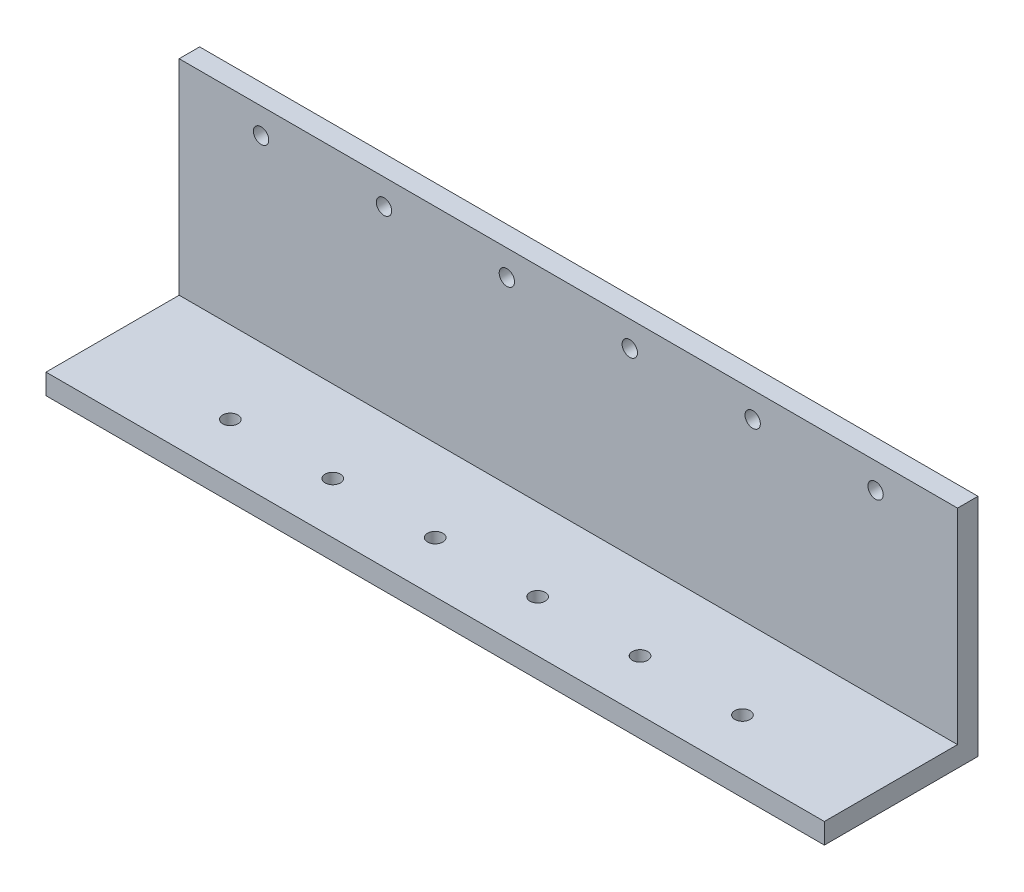
ISO-10303-21;
HEADER;
FILE_DESCRIPTION(('STEP AP214'),'2;1');
FILE_NAME('part.step','',(''),(''),'','','');
FILE_SCHEMA(('AUTOMOTIVE_DESIGN { 1 0 10303 214 1 1 1 1 }'));
ENDSEC;
DATA;
#1=APPLICATION_CONTEXT('core data for automotive mechanical design processes');
#2=APPLICATION_PROTOCOL_DEFINITION('international standard','automotive_design',2000,#1);
#3=PRODUCT_CONTEXT('',#1,'mechanical');
#4=PRODUCT('Part','Part','',(#3));
#5=PRODUCT_RELATED_PRODUCT_CATEGORY('part','',(#4));
#6=PRODUCT_DEFINITION_FORMATION('','',#4);
#7=PRODUCT_DEFINITION_CONTEXT('part definition',#1,'design');
#8=PRODUCT_DEFINITION('design','',#6,#7);
#9=PRODUCT_DEFINITION_SHAPE('','',#8);
#10=(LENGTH_UNIT() NAMED_UNIT(*) SI_UNIT(.MILLI.,.METRE.));
#11=(NAMED_UNIT(*) PLANE_ANGLE_UNIT() SI_UNIT($,.RADIAN.));
#12=(NAMED_UNIT(*) SI_UNIT($,.STERADIAN.) SOLID_ANGLE_UNIT());
#13=UNCERTAINTY_MEASURE_WITH_UNIT(LENGTH_MEASURE(1.E-05),#10,'distance_accuracy_value','');
#14=(GEOMETRIC_REPRESENTATION_CONTEXT(3) GLOBAL_UNCERTAINTY_ASSIGNED_CONTEXT((#13)) GLOBAL_UNIT_ASSIGNED_CONTEXT((#10,
#11,#12)) REPRESENTATION_CONTEXT('',''));
#15=CARTESIAN_POINT('',(0.,0.,0.));
#16=DIRECTION('',(0.,0.,1.));
#17=DIRECTION('',(1.,0.,0.));
#18=AXIS2_PLACEMENT_3D('',#15,#16,#17);
#19=CARTESIAN_POINT('',(0.,0.,2.));
#20=DIRECTION('',(0.,0.,-1.));
#21=DIRECTION('',(-1.,0.,0.));
#22=AXIS2_PLACEMENT_3D('',#19,#20,#21);
#23=PLANE('',#22);
#24=DIRECTION('',(0.,-1.,0.));
#25=VECTOR('',#24,1.);
#26=CARTESIAN_POINT('',(0.,0.,2.));
#27=LINE('',#26,#25);
#28=CARTESIAN_POINT('',(0.,20.,2.));
#29=VERTEX_POINT('',#28);
#30=CARTESIAN_POINT('',(0.,0.,2.));
#31=VERTEX_POINT('',#30);
#32=EDGE_CURVE('E102',#29,#31,#27,.T.);
#33=ORIENTED_EDGE('',*,*,#32,.T.);
#34=DIRECTION('',(1.,0.,0.));
#35=VECTOR('',#34,1.);
#36=CARTESIAN_POINT('',(0.,0.,2.));
#37=LINE('',#36,#35);
#38=CARTESIAN_POINT('',(76.,0.,2.));
#39=VERTEX_POINT('',#38);
#40=EDGE_CURVE('E78',#31,#39,#37,.T.);
#41=ORIENTED_EDGE('',*,*,#40,.T.);
#42=DIRECTION('',(0.,1.,0.));
#43=VECTOR('',#42,1.);
#44=CARTESIAN_POINT('',(76.,0.,2.));
#45=LINE('',#44,#43);
#46=CARTESIAN_POINT('',(76.,20.,2.));
#47=VERTEX_POINT('',#46);
#48=EDGE_CURVE('E100',#39,#47,#45,.T.);
#49=ORIENTED_EDGE('',*,*,#48,.T.);
#50=DIRECTION('',(-1.,0.,0.));
#51=VECTOR('',#50,1.);
#52=CARTESIAN_POINT('',(0.,20.,2.));
#53=LINE('',#52,#51);
#54=EDGE_CURVE('E57',#47,#29,#53,.T.);
#55=ORIENTED_EDGE('',*,*,#54,.T.);
#56=EDGE_LOOP('',(#33,#41,#49,#55));
#57=FACE_BOUND('',#56,.T.);
#58=CARTESIAN_POINT('',(44.,17.5,2.));
#59=DIRECTION('',(0.,0.,1.));
#60=DIRECTION('',(1.,0.,0.));
#61=AXIS2_PLACEMENT_3D('',#58,#59,#60);
#62=CIRCLE('',#61,0.749999999999999);
#63=CARTESIAN_POINT('',(44.75,17.5,2.));
#64=VERTEX_POINT('',#63);
#65=EDGE_CURVE('E116',#64,#64,#62,.T.);
#66=ORIENTED_EDGE('',*,*,#65,.F.);
#67=EDGE_LOOP('',(#66));
#68=FACE_BOUND('',#67,.T.);
#69=CARTESIAN_POINT('',(56.,17.5,2.));
#70=DIRECTION('',(0.,0.,1.));
#71=DIRECTION('',(1.,0.,0.));
#72=AXIS2_PLACEMENT_3D('',#69,#70,#71);
#73=CIRCLE('',#72,0.749999999999999);
#74=CARTESIAN_POINT('',(56.75,17.5,2.));
#75=VERTEX_POINT('',#74);
#76=EDGE_CURVE('E193',#75,#75,#73,.T.);
#77=ORIENTED_EDGE('',*,*,#76,.F.);
#78=EDGE_LOOP('',(#77));
#79=FACE_BOUND('',#78,.T.);
#80=CARTESIAN_POINT('',(68.,17.5,2.));
#81=DIRECTION('',(0.,0.,1.));
#82=DIRECTION('',(1.,0.,0.));
#83=AXIS2_PLACEMENT_3D('',#80,#81,#82);
#84=CIRCLE('',#83,0.749999999999999);
#85=CARTESIAN_POINT('',(68.75,17.5,2.));
#86=VERTEX_POINT('',#85);
#87=EDGE_CURVE('E185',#86,#86,#84,.T.);
#88=ORIENTED_EDGE('',*,*,#87,.F.);
#89=EDGE_LOOP('',(#88));
#90=FACE_BOUND('',#89,.T.);
#91=CARTESIAN_POINT('',(32.,17.5,2.));
#92=DIRECTION('',(0.,0.,1.));
#93=DIRECTION('',(1.,0.,0.));
#94=AXIS2_PLACEMENT_3D('',#91,#92,#93);
#95=CIRCLE('',#94,0.749999999999999);
#96=CARTESIAN_POINT('',(32.75,17.5,2.));
#97=VERTEX_POINT('',#96);
#98=EDGE_CURVE('E177',#97,#97,#95,.T.);
#99=ORIENTED_EDGE('',*,*,#98,.F.);
#100=EDGE_LOOP('',(#99));
#101=FACE_BOUND('',#100,.T.);
#102=CARTESIAN_POINT('',(20.,17.5,2.));
#103=DIRECTION('',(0.,0.,1.));
#104=DIRECTION('',(1.,0.,0.));
#105=AXIS2_PLACEMENT_3D('',#102,#103,#104);
#106=CIRCLE('',#105,0.749999999999999);
#107=CARTESIAN_POINT('',(20.75,17.5,2.));
#108=VERTEX_POINT('',#107);
#109=EDGE_CURVE('E169',#108,#108,#106,.T.);
#110=ORIENTED_EDGE('',*,*,#109,.F.);
#111=EDGE_LOOP('',(#110));
#112=FACE_BOUND('',#111,.T.);
#113=CARTESIAN_POINT('',(8.,17.5,2.));
#114=DIRECTION('',(0.,0.,1.));
#115=DIRECTION('',(1.,0.,0.));
#116=AXIS2_PLACEMENT_3D('',#113,#114,#115);
#117=CIRCLE('',#116,0.749999999999999);
#118=CARTESIAN_POINT('',(8.75,17.5,2.));
#119=VERTEX_POINT('',#118);
#120=EDGE_CURVE('E161',#119,#119,#117,.T.);
#121=ORIENTED_EDGE('',*,*,#120,.F.);
#122=EDGE_LOOP('',(#121));
#123=FACE_BOUND('',#122,.T.);
#124=ADVANCED_FACE('F39',(#57,#68,#79,#90,#101,#112,#123),#23,.F.);
#125=CARTESIAN_POINT('',(0.,0.,0.));
#126=DIRECTION('',(0.,0.,-1.));
#127=DIRECTION('',(-1.,0.,0.));
#128=AXIS2_PLACEMENT_3D('',#125,#126,#127);
#129=PLANE('',#128);
#130=CARTESIAN_POINT('',(20.,17.5,0.));
#131=DIRECTION('',(0.,0.,1.));
#132=DIRECTION('',(1.,0.,0.));
#133=AXIS2_PLACEMENT_3D('',#130,#131,#132);
#134=CIRCLE('',#133,0.749999999999999);
#135=CARTESIAN_POINT('',(20.75,17.5,0.));
#136=VERTEX_POINT('',#135);
#137=EDGE_CURVE('E165',#136,#136,#134,.T.);
#138=ORIENTED_EDGE('',*,*,#137,.T.);
#139=EDGE_LOOP('',(#138));
#140=FACE_BOUND('',#139,.T.);
#141=CARTESIAN_POINT('',(68.,17.5,0.));
#142=DIRECTION('',(0.,0.,1.));
#143=DIRECTION('',(1.,0.,0.));
#144=AXIS2_PLACEMENT_3D('',#141,#142,#143);
#145=CIRCLE('',#144,0.749999999999999);
#146=CARTESIAN_POINT('',(68.75,17.5,0.));
#147=VERTEX_POINT('',#146);
#148=EDGE_CURVE('E181',#147,#147,#145,.T.);
#149=ORIENTED_EDGE('',*,*,#148,.T.);
#150=EDGE_LOOP('',(#149));
#151=FACE_BOUND('',#150,.T.);
#152=CARTESIAN_POINT('',(44.,17.5,0.));
#153=DIRECTION('',(0.,0.,1.));
#154=DIRECTION('',(1.,0.,0.));
#155=AXIS2_PLACEMENT_3D('',#152,#153,#154);
#156=CIRCLE('',#155,0.749999999999999);
#157=CARTESIAN_POINT('',(44.75,17.5,0.));
#158=VERTEX_POINT('',#157);
#159=EDGE_CURVE('E197',#158,#158,#156,.T.);
#160=ORIENTED_EDGE('',*,*,#159,.T.);
#161=EDGE_LOOP('',(#160));
#162=FACE_BOUND('',#161,.T.);
#163=DIRECTION('',(0.,-1.,0.));
#164=VECTOR('',#163,1.);
#165=CARTESIAN_POINT('',(0.,0.,0.));
#166=LINE('',#165,#164);
#167=CARTESIAN_POINT('',(0.,20.,0.));
#168=VERTEX_POINT('',#167);
#169=CARTESIAN_POINT('',(0.,-2.,0.));
#170=VERTEX_POINT('',#169);
#171=EDGE_CURVE('E112',#168,#170,#166,.T.);
#172=ORIENTED_EDGE('',*,*,#171,.F.);
#173=DIRECTION('',(-1.,0.,0.));
#174=VECTOR('',#173,1.);
#175=CARTESIAN_POINT('',(0.,20.,0.));
#176=LINE('',#175,#174);
#177=CARTESIAN_POINT('',(76.,20.,0.));
#178=VERTEX_POINT('',#177);
#179=EDGE_CURVE('E119',#178,#168,#176,.T.);
#180=ORIENTED_EDGE('',*,*,#179,.F.);
#181=DIRECTION('',(0.,1.,0.));
#182=VECTOR('',#181,1.);
#183=CARTESIAN_POINT('',(76.,0.,0.));
#184=LINE('',#183,#182);
#185=CARTESIAN_POINT('',(76.,-2.,0.));
#186=VERTEX_POINT('',#185);
#187=EDGE_CURVE('E69',#186,#178,#184,.T.);
#188=ORIENTED_EDGE('',*,*,#187,.F.);
#189=DIRECTION('',(1.,0.,0.));
#190=VECTOR('',#189,1.);
#191=CARTESIAN_POINT('',(76.,-2.,0.));
#192=LINE('',#191,#190);
#193=EDGE_CURVE('E134',#170,#186,#192,.T.);
#194=ORIENTED_EDGE('',*,*,#193,.F.);
#195=EDGE_LOOP('',(#172,#180,#188,#194));
#196=FACE_BOUND('',#195,.T.);
#197=CARTESIAN_POINT('',(56.,17.5,0.));
#198=DIRECTION('',(0.,0.,1.));
#199=DIRECTION('',(1.,0.,0.));
#200=AXIS2_PLACEMENT_3D('',#197,#198,#199);
#201=CIRCLE('',#200,0.749999999999999);
#202=CARTESIAN_POINT('',(56.75,17.5,0.));
#203=VERTEX_POINT('',#202);
#204=EDGE_CURVE('E189',#203,#203,#201,.T.);
#205=ORIENTED_EDGE('',*,*,#204,.T.);
#206=EDGE_LOOP('',(#205));
#207=FACE_BOUND('',#206,.T.);
#208=CARTESIAN_POINT('',(32.,17.5,0.));
#209=DIRECTION('',(0.,0.,1.));
#210=DIRECTION('',(1.,0.,0.));
#211=AXIS2_PLACEMENT_3D('',#208,#209,#210);
#212=CIRCLE('',#211,0.749999999999999);
#213=CARTESIAN_POINT('',(32.75,17.5,0.));
#214=VERTEX_POINT('',#213);
#215=EDGE_CURVE('E173',#214,#214,#212,.T.);
#216=ORIENTED_EDGE('',*,*,#215,.T.);
#217=EDGE_LOOP('',(#216));
#218=FACE_BOUND('',#217,.T.);
#219=CARTESIAN_POINT('',(8.,17.5,0.));
#220=DIRECTION('',(0.,0.,1.));
#221=DIRECTION('',(1.,0.,0.));
#222=AXIS2_PLACEMENT_3D('',#219,#220,#221);
#223=CIRCLE('',#222,0.749999999999999);
#224=CARTESIAN_POINT('',(8.75,17.5,0.));
#225=VERTEX_POINT('',#224);
#226=EDGE_CURVE('E160',#225,#225,#223,.T.);
#227=ORIENTED_EDGE('',*,*,#226,.T.);
#228=EDGE_LOOP('',(#227));
#229=FACE_BOUND('',#228,.T.);
#230=ADVANCED_FACE('F131',(#140,#151,#162,#196,#207,#218,#229),#129,.T.);
#231=CARTESIAN_POINT('',(0.,0.,2.));
#232=DIRECTION('',(1.,0.,0.));
#233=DIRECTION('',(0.,0.,-1.));
#234=AXIS2_PLACEMENT_3D('',#231,#232,#233);
#235=PLANE('',#234);
#236=ORIENTED_EDGE('',*,*,#171,.T.);
#237=DIRECTION('',(0.,0.,-1.));
#238=VECTOR('',#237,1.);
#239=CARTESIAN_POINT('',(0.,-2.,0.));
#240=LINE('',#239,#238);
#241=CARTESIAN_POINT('',(0.,-2.,15.));
#242=VERTEX_POINT('',#241);
#243=EDGE_CURVE('E141',#242,#170,#240,.T.);
#244=ORIENTED_EDGE('',*,*,#243,.F.);
#245=DIRECTION('',(0.,1.,0.));
#246=VECTOR('',#245,1.);
#247=CARTESIAN_POINT('',(0.,-2.,15.));
#248=LINE('',#247,#246);
#249=CARTESIAN_POINT('',(0.,0.,15.));
#250=VERTEX_POINT('',#249);
#251=EDGE_CURVE('E140',#242,#250,#248,.T.);
#252=ORIENTED_EDGE('',*,*,#251,.T.);
#253=DIRECTION('',(0.,0.,-1.));
#254=VECTOR('',#253,1.);
#255=CARTESIAN_POINT('',(0.,0.,0.));
#256=LINE('',#255,#254);
#257=EDGE_CURVE('E154',#250,#31,#256,.T.);
#258=ORIENTED_EDGE('',*,*,#257,.T.);
#259=ORIENTED_EDGE('',*,*,#32,.F.);
#260=DIRECTION('',(0.,0.,-1.));
#261=VECTOR('',#260,1.);
#262=CARTESIAN_POINT('',(0.,20.,2.));
#263=LINE('',#262,#261);
#264=EDGE_CURVE('E49',#29,#168,#263,.T.);
#265=ORIENTED_EDGE('',*,*,#264,.T.);
#266=EDGE_LOOP('',(#236,#244,#252,#258,#259,#265));
#267=FACE_BOUND('',#266,.T.);
#268=ADVANCED_FACE('F41',(#267),#235,.F.);
#269=CARTESIAN_POINT('',(76.,0.,2.));
#270=DIRECTION('',(-1.,0.,0.));
#271=DIRECTION('',(0.,0.,1.));
#272=AXIS2_PLACEMENT_3D('',#269,#270,#271);
#273=PLANE('',#272);
#274=ORIENTED_EDGE('',*,*,#187,.T.);
#275=DIRECTION('',(0.,0.,-1.));
#276=VECTOR('',#275,1.);
#277=CARTESIAN_POINT('',(76.,20.,2.));
#278=LINE('',#277,#276);
#279=EDGE_CURVE('E11',#47,#178,#278,.T.);
#280=ORIENTED_EDGE('',*,*,#279,.F.);
#281=ORIENTED_EDGE('',*,*,#48,.F.);
#282=DIRECTION('',(0.,0.,1.));
#283=VECTOR('',#282,1.);
#284=CARTESIAN_POINT('',(76.,0.,0.));
#285=LINE('',#284,#283);
#286=CARTESIAN_POINT('',(76.,0.,15.));
#287=VERTEX_POINT('',#286);
#288=EDGE_CURVE('E87',#39,#287,#285,.T.);
#289=ORIENTED_EDGE('',*,*,#288,.T.);
#290=DIRECTION('',(0.,1.,0.));
#291=VECTOR('',#290,1.);
#292=CARTESIAN_POINT('',(76.,-2.,15.));
#293=LINE('',#292,#291);
#294=CARTESIAN_POINT('',(76.,-2.,15.));
#295=VERTEX_POINT('',#294);
#296=EDGE_CURVE('E146',#295,#287,#293,.T.);
#297=ORIENTED_EDGE('',*,*,#296,.F.);
#298=DIRECTION('',(0.,0.,1.));
#299=VECTOR('',#298,1.);
#300=CARTESIAN_POINT('',(76.,-2.,0.));
#301=LINE('',#300,#299);
#302=EDGE_CURVE('E156',#186,#295,#301,.T.);
#303=ORIENTED_EDGE('',*,*,#302,.F.);
#304=EDGE_LOOP('',(#274,#280,#281,#289,#297,#303));
#305=FACE_BOUND('',#304,.T.);
#306=ADVANCED_FACE('F105',(#305),#273,.F.);
#307=CARTESIAN_POINT('',(0.,20.,2.));
#308=DIRECTION('',(0.,-1.,0.));
#309=DIRECTION('',(0.,0.,-1.));
#310=AXIS2_PLACEMENT_3D('',#307,#308,#309);
#311=PLANE('',#310);
#312=ORIENTED_EDGE('',*,*,#179,.T.);
#313=ORIENTED_EDGE('',*,*,#264,.F.);
#314=ORIENTED_EDGE('',*,*,#54,.F.);
#315=ORIENTED_EDGE('',*,*,#279,.T.);
#316=EDGE_LOOP('',(#312,#313,#314,#315));
#317=FACE_BOUND('',#316,.T.);
#318=ADVANCED_FACE('F213',(#317),#311,.F.);
#319=CARTESIAN_POINT('',(44.,17.5,2.));
#320=DIRECTION('',(0.,0.,-1.));
#321=DIRECTION('',(-1.,0.,0.));
#322=AXIS2_PLACEMENT_3D('',#319,#320,#321);
#323=CYLINDRICAL_SURFACE('',#322,0.749999999999999);
#324=ORIENTED_EDGE('',*,*,#65,.T.);
#325=EDGE_LOOP('',(#324));
#326=FACE_BOUND('',#325,.T.);
#327=ORIENTED_EDGE('',*,*,#159,.F.);
#328=EDGE_LOOP('',(#327));
#329=FACE_BOUND('',#328,.T.);
#330=ADVANCED_FACE('F210',(#326,#329),#323,.F.);
#331=CARTESIAN_POINT('',(56.,17.5,2.));
#332=DIRECTION('',(0.,0.,-1.));
#333=DIRECTION('',(-1.,0.,0.));
#334=AXIS2_PLACEMENT_3D('',#331,#332,#333);
#335=CYLINDRICAL_SURFACE('',#334,0.749999999999999);
#336=ORIENTED_EDGE('',*,*,#76,.T.);
#337=EDGE_LOOP('',(#336));
#338=FACE_BOUND('',#337,.T.);
#339=ORIENTED_EDGE('',*,*,#204,.F.);
#340=EDGE_LOOP('',(#339));
#341=FACE_BOUND('',#340,.T.);
#342=ADVANCED_FACE('F212',(#338,#341),#335,.F.);
#343=CARTESIAN_POINT('',(68.,17.5,2.));
#344=DIRECTION('',(0.,0.,-1.));
#345=DIRECTION('',(-1.,0.,0.));
#346=AXIS2_PLACEMENT_3D('',#343,#344,#345);
#347=CYLINDRICAL_SURFACE('',#346,0.749999999999999);
#348=ORIENTED_EDGE('',*,*,#87,.T.);
#349=EDGE_LOOP('',(#348));
#350=FACE_BOUND('',#349,.T.);
#351=ORIENTED_EDGE('',*,*,#148,.F.);
#352=EDGE_LOOP('',(#351));
#353=FACE_BOUND('',#352,.T.);
#354=ADVANCED_FACE('F220',(#350,#353),#347,.F.);
#355=CARTESIAN_POINT('',(32.,17.5,2.));
#356=DIRECTION('',(0.,0.,-1.));
#357=DIRECTION('',(-1.,0.,0.));
#358=AXIS2_PLACEMENT_3D('',#355,#356,#357);
#359=CYLINDRICAL_SURFACE('',#358,0.749999999999999);
#360=ORIENTED_EDGE('',*,*,#98,.T.);
#361=EDGE_LOOP('',(#360));
#362=FACE_BOUND('',#361,.T.);
#363=ORIENTED_EDGE('',*,*,#215,.F.);
#364=EDGE_LOOP('',(#363));
#365=FACE_BOUND('',#364,.T.);
#366=ADVANCED_FACE('F268',(#362,#365),#359,.F.);
#367=CARTESIAN_POINT('',(20.,17.5,2.));
#368=DIRECTION('',(0.,0.,-1.));
#369=DIRECTION('',(-1.,0.,0.));
#370=AXIS2_PLACEMENT_3D('',#367,#368,#369);
#371=CYLINDRICAL_SURFACE('',#370,0.749999999999999);
#372=ORIENTED_EDGE('',*,*,#109,.T.);
#373=EDGE_LOOP('',(#372));
#374=FACE_BOUND('',#373,.T.);
#375=ORIENTED_EDGE('',*,*,#137,.F.);
#376=EDGE_LOOP('',(#375));
#377=FACE_BOUND('',#376,.T.);
#378=ADVANCED_FACE('F257',(#374,#377),#371,.F.);
#379=CARTESIAN_POINT('',(8.,17.5,2.));
#380=DIRECTION('',(0.,0.,-1.));
#381=DIRECTION('',(-1.,0.,0.));
#382=AXIS2_PLACEMENT_3D('',#379,#380,#381);
#383=CYLINDRICAL_SURFACE('',#382,0.749999999999999);
#384=ORIENTED_EDGE('',*,*,#120,.T.);
#385=EDGE_LOOP('',(#384));
#386=FACE_BOUND('',#385,.T.);
#387=ORIENTED_EDGE('',*,*,#226,.F.);
#388=EDGE_LOOP('',(#387));
#389=FACE_BOUND('',#388,.T.);
#390=ADVANCED_FACE('F252',(#386,#389),#383,.F.);
#391=CARTESIAN_POINT('',(0.,-2.,0.));
#392=DIRECTION('',(0.,-1.,0.));
#393=DIRECTION('',(0.,0.,-1.));
#394=AXIS2_PLACEMENT_3D('',#391,#392,#393);
#395=PLANE('',#394);
#396=CARTESIAN_POINT('',(53.,-2.,10.));
#397=DIRECTION('',(0.,-1.,0.));
#398=DIRECTION('',(0.,0.,-1.));
#399=AXIS2_PLACEMENT_3D('',#396,#397,#398);
#400=CIRCLE('',#399,0.749999999999999);
#401=CARTESIAN_POINT('',(53.,-2.,9.25000000000001));
#402=VERTEX_POINT('',#401);
#403=EDGE_CURVE('E421',#402,#402,#400,.T.);
#404=ORIENTED_EDGE('',*,*,#403,.F.);
#405=EDGE_LOOP('',(#404));
#406=FACE_BOUND('',#405,.T.);
#407=CARTESIAN_POINT('',(33.,-2.,10.));
#408=DIRECTION('',(0.,-1.,0.));
#409=DIRECTION('',(0.,0.,-1.));
#410=AXIS2_PLACEMENT_3D('',#407,#408,#409);
#411=CIRCLE('',#410,0.749999999999999);
#412=CARTESIAN_POINT('',(33.,-2.,9.25));
#413=VERTEX_POINT('',#412);
#414=EDGE_CURVE('E437',#413,#413,#411,.T.);
#415=ORIENTED_EDGE('',*,*,#414,.F.);
#416=EDGE_LOOP('',(#415));
#417=FACE_BOUND('',#416,.T.);
#418=CARTESIAN_POINT('',(13.,-2.,10.));
#419=DIRECTION('',(0.,-1.,0.));
#420=DIRECTION('',(0.,0.,-1.));
#421=AXIS2_PLACEMENT_3D('',#418,#419,#420);
#422=CIRCLE('',#421,0.75);
#423=CARTESIAN_POINT('',(13.,-2.,9.25));
#424=VERTEX_POINT('',#423);
#425=EDGE_CURVE('E97',#424,#424,#422,.T.);
#426=ORIENTED_EDGE('',*,*,#425,.F.);
#427=EDGE_LOOP('',(#426));
#428=FACE_BOUND('',#427,.T.);
#429=ORIENTED_EDGE('',*,*,#302,.T.);
#430=DIRECTION('',(-1.,0.,0.));
#431=VECTOR('',#430,1.);
#432=CARTESIAN_POINT('',(76.,-2.,15.));
#433=LINE('',#432,#431);
#434=EDGE_CURVE('E148',#295,#242,#433,.T.);
#435=ORIENTED_EDGE('',*,*,#434,.T.);
#436=ORIENTED_EDGE('',*,*,#243,.T.);
#437=ORIENTED_EDGE('',*,*,#193,.T.);
#438=EDGE_LOOP('',(#429,#435,#436,#437));
#439=FACE_BOUND('',#438,.T.);
#440=CARTESIAN_POINT('',(23.,-2.,10.));
#441=DIRECTION('',(0.,-1.,0.));
#442=DIRECTION('',(0.,0.,-1.));
#443=AXIS2_PLACEMENT_3D('',#440,#441,#442);
#444=CIRCLE('',#443,0.750000000000002);
#445=CARTESIAN_POINT('',(23.,-2.,9.25));
#446=VERTEX_POINT('',#445);
#447=EDGE_CURVE('E445',#446,#446,#444,.T.);
#448=ORIENTED_EDGE('',*,*,#447,.F.);
#449=EDGE_LOOP('',(#448));
#450=FACE_BOUND('',#449,.T.);
#451=CARTESIAN_POINT('',(43.,-2.,10.));
#452=DIRECTION('',(0.,-1.,0.));
#453=DIRECTION('',(0.,0.,-1.));
#454=AXIS2_PLACEMENT_3D('',#451,#452,#453);
#455=CIRCLE('',#454,0.749999999999999);
#456=CARTESIAN_POINT('',(43.,-2.,9.25));
#457=VERTEX_POINT('',#456);
#458=EDGE_CURVE('E429',#457,#457,#455,.T.);
#459=ORIENTED_EDGE('',*,*,#458,.F.);
#460=EDGE_LOOP('',(#459));
#461=FACE_BOUND('',#460,.T.);
#462=CARTESIAN_POINT('',(63.,-2.,10.));
#463=DIRECTION('',(0.,-1.,0.));
#464=DIRECTION('',(0.,0.,-1.));
#465=AXIS2_PLACEMENT_3D('',#462,#463,#464);
#466=CIRCLE('',#465,0.749999999999999);
#467=CARTESIAN_POINT('',(63.,-2.,9.25000000000001));
#468=VERTEX_POINT('',#467);
#469=EDGE_CURVE('E410',#468,#468,#466,.T.);
#470=ORIENTED_EDGE('',*,*,#469,.F.);
#471=EDGE_LOOP('',(#470));
#472=FACE_BOUND('',#471,.T.);
#473=ADVANCED_FACE('F256',(#406,#417,#428,#439,#450,#461,#472),#395,.T.);
#474=CARTESIAN_POINT('',(0.,0.,0.));
#475=DIRECTION('',(0.,-1.,0.));
#476=DIRECTION('',(0.,0.,-1.));
#477=AXIS2_PLACEMENT_3D('',#474,#475,#476);
#478=PLANE('',#477);
#479=ORIENTED_EDGE('',*,*,#40,.F.);
#480=ORIENTED_EDGE('',*,*,#257,.F.);
#481=DIRECTION('',(-1.,0.,0.));
#482=VECTOR('',#481,1.);
#483=CARTESIAN_POINT('',(76.,0.,15.));
#484=LINE('',#483,#482);
#485=EDGE_CURVE('E92',#287,#250,#484,.T.);
#486=ORIENTED_EDGE('',*,*,#485,.F.);
#487=ORIENTED_EDGE('',*,*,#288,.F.);
#488=EDGE_LOOP('',(#479,#480,#486,#487));
#489=FACE_BOUND('',#488,.T.);
#490=CARTESIAN_POINT('',(13.,0.,10.));
#491=DIRECTION('',(0.,-1.,0.));
#492=DIRECTION('',(0.,0.,-1.));
#493=AXIS2_PLACEMENT_3D('',#490,#491,#492);
#494=CIRCLE('',#493,0.75);
#495=CARTESIAN_POINT('',(13.,0.,9.25));
#496=VERTEX_POINT('',#495);
#497=EDGE_CURVE('E449',#496,#496,#494,.T.);
#498=ORIENTED_EDGE('',*,*,#497,.T.);
#499=EDGE_LOOP('',(#498));
#500=FACE_BOUND('',#499,.T.);
#501=CARTESIAN_POINT('',(23.,0.,10.));
#502=DIRECTION('',(0.,-1.,0.));
#503=DIRECTION('',(0.,0.,-1.));
#504=AXIS2_PLACEMENT_3D('',#501,#502,#503);
#505=CIRCLE('',#504,0.750000000000002);
#506=CARTESIAN_POINT('',(23.,0.,9.25));
#507=VERTEX_POINT('',#506);
#508=EDGE_CURVE('E441',#507,#507,#505,.T.);
#509=ORIENTED_EDGE('',*,*,#508,.T.);
#510=EDGE_LOOP('',(#509));
#511=FACE_BOUND('',#510,.T.);
#512=CARTESIAN_POINT('',(33.,0.,10.));
#513=DIRECTION('',(0.,-1.,0.));
#514=DIRECTION('',(0.,0.,-1.));
#515=AXIS2_PLACEMENT_3D('',#512,#513,#514);
#516=CIRCLE('',#515,0.749999999999999);
#517=CARTESIAN_POINT('',(33.,0.,9.25));
#518=VERTEX_POINT('',#517);
#519=EDGE_CURVE('E433',#518,#518,#516,.T.);
#520=ORIENTED_EDGE('',*,*,#519,.T.);
#521=EDGE_LOOP('',(#520));
#522=FACE_BOUND('',#521,.T.);
#523=CARTESIAN_POINT('',(43.,0.,10.));
#524=DIRECTION('',(0.,-1.,0.));
#525=DIRECTION('',(0.,0.,-1.));
#526=AXIS2_PLACEMENT_3D('',#523,#524,#525);
#527=CIRCLE('',#526,0.749999999999999);
#528=CARTESIAN_POINT('',(43.,0.,9.25));
#529=VERTEX_POINT('',#528);
#530=EDGE_CURVE('E425',#529,#529,#527,.T.);
#531=ORIENTED_EDGE('',*,*,#530,.T.);
#532=EDGE_LOOP('',(#531));
#533=FACE_BOUND('',#532,.T.);
#534=CARTESIAN_POINT('',(53.,0.,10.));
#535=DIRECTION('',(0.,-1.,0.));
#536=DIRECTION('',(0.,0.,-1.));
#537=AXIS2_PLACEMENT_3D('',#534,#535,#536);
#538=CIRCLE('',#537,0.749999999999999);
#539=CARTESIAN_POINT('',(53.,0.,9.25000000000001));
#540=VERTEX_POINT('',#539);
#541=EDGE_CURVE('E418',#540,#540,#538,.T.);
#542=ORIENTED_EDGE('',*,*,#541,.T.);
#543=EDGE_LOOP('',(#542));
#544=FACE_BOUND('',#543,.T.);
#545=CARTESIAN_POINT('',(63.,0.,10.));
#546=DIRECTION('',(0.,-1.,0.));
#547=DIRECTION('',(0.,0.,-1.));
#548=AXIS2_PLACEMENT_3D('',#545,#546,#547);
#549=CIRCLE('',#548,0.749999999999999);
#550=CARTESIAN_POINT('',(63.,0.,9.25000000000001));
#551=VERTEX_POINT('',#550);
#552=EDGE_CURVE('E413',#551,#551,#549,.T.);
#553=ORIENTED_EDGE('',*,*,#552,.T.);
#554=EDGE_LOOP('',(#553));
#555=FACE_BOUND('',#554,.T.);
#556=ADVANCED_FACE('F88',(#489,#500,#511,#522,#533,#544,#555),#478,.F.);
#557=CARTESIAN_POINT('',(76.,-2.,15.));
#558=DIRECTION('',(0.,0.,-1.));
#559=DIRECTION('',(-1.,0.,0.));
#560=AXIS2_PLACEMENT_3D('',#557,#558,#559);
#561=PLANE('',#560);
#562=ORIENTED_EDGE('',*,*,#485,.T.);
#563=ORIENTED_EDGE('',*,*,#251,.F.);
#564=ORIENTED_EDGE('',*,*,#434,.F.);
#565=ORIENTED_EDGE('',*,*,#296,.T.);
#566=EDGE_LOOP('',(#562,#563,#564,#565));
#567=FACE_BOUND('',#566,.T.);
#568=ADVANCED_FACE('F334',(#567),#561,.F.);
#569=CARTESIAN_POINT('',(13.,-2.,10.));
#570=DIRECTION('',(0.,1.,0.));
#571=DIRECTION('',(0.,0.,1.));
#572=AXIS2_PLACEMENT_3D('',#569,#570,#571);
#573=CYLINDRICAL_SURFACE('',#572,0.75);
#574=ORIENTED_EDGE('',*,*,#425,.T.);
#575=EDGE_LOOP('',(#574));
#576=FACE_BOUND('',#575,.T.);
#577=ORIENTED_EDGE('',*,*,#497,.F.);
#578=EDGE_LOOP('',(#577));
#579=FACE_BOUND('',#578,.T.);
#580=ADVANCED_FACE('F342',(#576,#579),#573,.F.);
#581=CARTESIAN_POINT('',(23.,-2.,10.));
#582=DIRECTION('',(0.,1.,0.));
#583=DIRECTION('',(0.,0.,1.));
#584=AXIS2_PLACEMENT_3D('',#581,#582,#583);
#585=CYLINDRICAL_SURFACE('',#584,0.750000000000002);
#586=ORIENTED_EDGE('',*,*,#447,.T.);
#587=EDGE_LOOP('',(#586));
#588=FACE_BOUND('',#587,.T.);
#589=ORIENTED_EDGE('',*,*,#508,.F.);
#590=EDGE_LOOP('',(#589));
#591=FACE_BOUND('',#590,.T.);
#592=ADVANCED_FACE('F351',(#588,#591),#585,.F.);
#593=CARTESIAN_POINT('',(33.,-2.,10.));
#594=DIRECTION('',(0.,1.,0.));
#595=DIRECTION('',(0.,0.,1.));
#596=AXIS2_PLACEMENT_3D('',#593,#594,#595);
#597=CYLINDRICAL_SURFACE('',#596,0.749999999999999);
#598=ORIENTED_EDGE('',*,*,#414,.T.);
#599=EDGE_LOOP('',(#598));
#600=FACE_BOUND('',#599,.T.);
#601=ORIENTED_EDGE('',*,*,#519,.F.);
#602=EDGE_LOOP('',(#601));
#603=FACE_BOUND('',#602,.T.);
#604=ADVANCED_FACE('F360',(#600,#603),#597,.F.);
#605=CARTESIAN_POINT('',(43.,-2.,10.));
#606=DIRECTION('',(0.,1.,0.));
#607=DIRECTION('',(0.,0.,1.));
#608=AXIS2_PLACEMENT_3D('',#605,#606,#607);
#609=CYLINDRICAL_SURFACE('',#608,0.749999999999999);
#610=ORIENTED_EDGE('',*,*,#458,.T.);
#611=EDGE_LOOP('',(#610));
#612=FACE_BOUND('',#611,.T.);
#613=ORIENTED_EDGE('',*,*,#530,.F.);
#614=EDGE_LOOP('',(#613));
#615=FACE_BOUND('',#614,.T.);
#616=ADVANCED_FACE('F369',(#612,#615),#609,.F.);
#617=CARTESIAN_POINT('',(53.,-2.,10.));
#618=DIRECTION('',(0.,1.,0.));
#619=DIRECTION('',(0.,0.,1.));
#620=AXIS2_PLACEMENT_3D('',#617,#618,#619);
#621=CYLINDRICAL_SURFACE('',#620,0.749999999999999);
#622=ORIENTED_EDGE('',*,*,#403,.T.);
#623=EDGE_LOOP('',(#622));
#624=FACE_BOUND('',#623,.T.);
#625=ORIENTED_EDGE('',*,*,#541,.F.);
#626=EDGE_LOOP('',(#625));
#627=FACE_BOUND('',#626,.T.);
#628=ADVANCED_FACE('F378',(#624,#627),#621,.F.);
#629=CARTESIAN_POINT('',(63.,-2.,10.));
#630=DIRECTION('',(0.,1.,0.));
#631=DIRECTION('',(0.,0.,1.));
#632=AXIS2_PLACEMENT_3D('',#629,#630,#631);
#633=CYLINDRICAL_SURFACE('',#632,0.749999999999999);
#634=ORIENTED_EDGE('',*,*,#469,.T.);
#635=EDGE_LOOP('',(#634));
#636=FACE_BOUND('',#635,.T.);
#637=ORIENTED_EDGE('',*,*,#552,.F.);
#638=EDGE_LOOP('',(#637));
#639=FACE_BOUND('',#638,.T.);
#640=ADVANCED_FACE('F387',(#636,#639),#633,.F.);
#641=CLOSED_SHELL('',(#124,#230,#268,#306,#318,#330,#342,#354,#366,#378,#390,#473,#556,#568,
#580,#592,#604,#616,#628,#640));
#642=MANIFOLD_SOLID_BREP('B2',#641);
#643=ADVANCED_BREP_SHAPE_REPRESENTATION('',(#18,#642),#14);
#644=SHAPE_DEFINITION_REPRESENTATION(#9,#643);
ENDSEC;
END-ISO-10303-21;
